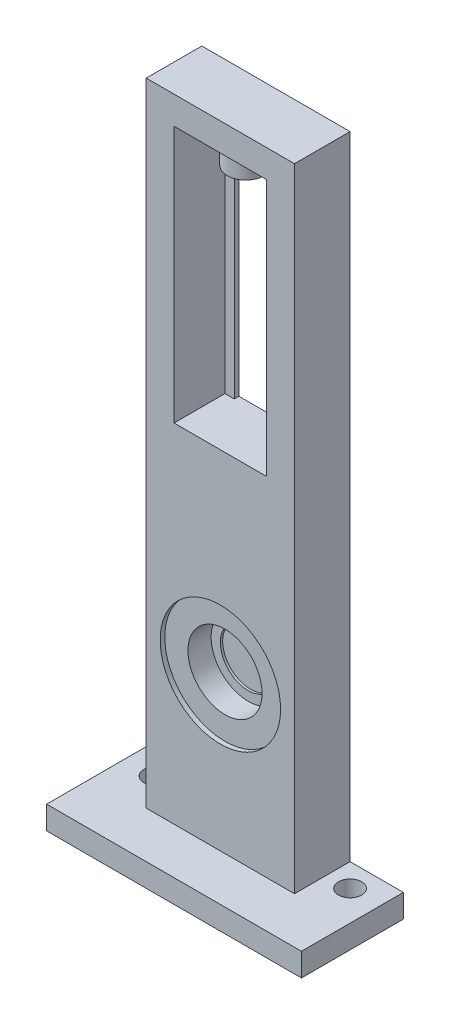
ISO-10303-21;
HEADER;
FILE_DESCRIPTION(('STEP AP214'),'2;1');
FILE_NAME('part.step','',(''),(''),'','','');
FILE_SCHEMA(('AUTOMOTIVE_DESIGN { 1 0 10303 214 1 1 1 1 }'));
ENDSEC;
DATA;
#1=APPLICATION_CONTEXT('core data for automotive mechanical design processes');
#2=APPLICATION_PROTOCOL_DEFINITION('international standard','automotive_design',2000,#1);
#3=PRODUCT_CONTEXT('',#1,'mechanical');
#4=PRODUCT('Part','Part','',(#3));
#5=PRODUCT_RELATED_PRODUCT_CATEGORY('part','',(#4));
#6=PRODUCT_DEFINITION_FORMATION('','',#4);
#7=PRODUCT_DEFINITION_CONTEXT('part definition',#1,'design');
#8=PRODUCT_DEFINITION('design','',#6,#7);
#9=PRODUCT_DEFINITION_SHAPE('','',#8);
#10=(LENGTH_UNIT() NAMED_UNIT(*) SI_UNIT(.MILLI.,.METRE.));
#11=(NAMED_UNIT(*) PLANE_ANGLE_UNIT() SI_UNIT($,.RADIAN.));
#12=(NAMED_UNIT(*) SI_UNIT($,.STERADIAN.) SOLID_ANGLE_UNIT());
#13=UNCERTAINTY_MEASURE_WITH_UNIT(LENGTH_MEASURE(1.E-05),#10,'distance_accuracy_value','');
#14=(GEOMETRIC_REPRESENTATION_CONTEXT(3) GLOBAL_UNCERTAINTY_ASSIGNED_CONTEXT((#13)) GLOBAL_UNIT_ASSIGNED_CONTEXT((#10,
#11,#12)) REPRESENTATION_CONTEXT('',''));
#15=CARTESIAN_POINT('',(0.,0.,0.));
#16=DIRECTION('',(0.,0.,1.));
#17=DIRECTION('',(1.,0.,0.));
#18=AXIS2_PLACEMENT_3D('',#15,#16,#17);
#19=CARTESIAN_POINT('',(10.,0.,11.));
#20=DIRECTION('',(1.,0.,0.));
#21=DIRECTION('',(0.,1.,0.));
#22=AXIS2_PLACEMENT_3D('',#19,#20,#21);
#23=PLANE('',#22);
#24=DIRECTION('',(0.,-1.,0.));
#25=VECTOR('',#24,1.);
#26=CARTESIAN_POINT('',(10.,0.,0.));
#27=LINE('',#26,#25);
#28=CARTESIAN_POINT('',(9.99999999999999,55.475378035092,0.));
#29=VERTEX_POINT('',#28);
#30=CARTESIAN_POINT('',(10.,0.,0.));
#31=VERTEX_POINT('',#30);
#32=EDGE_CURVE('E267',#29,#31,#27,.T.);
#33=ORIENTED_EDGE('',*,*,#32,.T.);
#34=DIRECTION('',(0.,0.,-1.));
#35=VECTOR('',#34,1.);
#36=CARTESIAN_POINT('',(10.,0.,11.));
#37=LINE('',#36,#35);
#38=CARTESIAN_POINT('',(10.,0.,11.));
#39=VERTEX_POINT('',#38);
#40=EDGE_CURVE('E305',#39,#31,#37,.T.);
#41=ORIENTED_EDGE('',*,*,#40,.F.);
#42=DIRECTION('',(0.,-1.,0.));
#43=VECTOR('',#42,1.);
#44=CARTESIAN_POINT('',(10.,0.,11.));
#45=LINE('',#44,#43);
#46=CARTESIAN_POINT('',(9.99999999999999,55.475378035092,11.));
#47=VERTEX_POINT('',#46);
#48=EDGE_CURVE('E268',#47,#39,#45,.T.);
#49=ORIENTED_EDGE('',*,*,#48,.F.);
#50=DIRECTION('',(0.,0.,-1.));
#51=VECTOR('',#50,1.);
#52=CARTESIAN_POINT('',(9.99999999999999,55.475378035092,11.));
#53=LINE('',#52,#51);
#54=EDGE_CURVE('E283',#47,#29,#53,.T.);
#55=ORIENTED_EDGE('',*,*,#54,.T.);
#56=EDGE_LOOP('',(#33,#41,#49,#55));
#57=FACE_BOUND('',#56,.T.);
#58=ADVANCED_FACE('F34',(#57),#23,.F.);
#59=CARTESIAN_POINT('',(16.,0.,11.));
#60=DIRECTION('',(-1.,0.,0.));
#61=DIRECTION('',(0.,-1.,0.));
#62=AXIS2_PLACEMENT_3D('',#59,#60,#61);
#63=PLANE('',#62);
#64=DIRECTION('',(0.,1.,0.));
#65=VECTOR('',#64,1.);
#66=CARTESIAN_POINT('',(16.,0.,11.));
#67=LINE('',#66,#65);
#68=CARTESIAN_POINT('',(16.,-75.,11.));
#69=VERTEX_POINT('',#68);
#70=CARTESIAN_POINT('',(16.,61.475378035092,11.));
#71=VERTEX_POINT('',#70);
#72=EDGE_CURVE('E271',#69,#71,#67,.T.);
#73=ORIENTED_EDGE('',*,*,#72,.F.);
#74=DIRECTION('',(0.,0.,-1.));
#75=VECTOR('',#74,1.);
#76=CARTESIAN_POINT('',(16.,-75.,11.));
#77=LINE('',#76,#75);
#78=CARTESIAN_POINT('',(16.,-75.,-1.));
#79=VERTEX_POINT('',#78);
#80=EDGE_CURVE('E204',#69,#79,#77,.T.);
#81=ORIENTED_EDGE('',*,*,#80,.T.);
#82=DIRECTION('',(0.,-1.,0.));
#83=VECTOR('',#82,1.);
#84=CARTESIAN_POINT('',(16.,0.,-1.));
#85=LINE('',#84,#83);
#86=CARTESIAN_POINT('',(16.,61.475378035092,-1.));
#87=VERTEX_POINT('',#86);
#88=EDGE_CURVE('E234',#87,#79,#85,.T.);
#89=ORIENTED_EDGE('',*,*,#88,.F.);
#90=DIRECTION('',(0.,0.,-1.));
#91=VECTOR('',#90,1.);
#92=CARTESIAN_POINT('',(16.,61.475378035092,11.));
#93=LINE('',#92,#91);
#94=EDGE_CURVE('E303',#71,#87,#93,.T.);
#95=ORIENTED_EDGE('',*,*,#94,.F.);
#96=EDGE_LOOP('',(#73,#81,#89,#95));
#97=FACE_BOUND('',#96,.T.);
#98=ADVANCED_FACE('F329',(#97),#63,.F.);
#99=CARTESIAN_POINT('',(-16.,61.4753780350919,11.));
#100=DIRECTION('',(0.,-1.,0.));
#101=DIRECTION('',(1.,0.,0.));
#102=AXIS2_PLACEMENT_3D('',#99,#100,#101);
#103=PLANE('',#102);
#104=ORIENTED_EDGE('',*,*,#94,.T.);
#105=DIRECTION('',(1.,0.,0.));
#106=VECTOR('',#105,1.);
#107=CARTESIAN_POINT('',(16.,61.475378035092,-1.));
#108=LINE('',#107,#106);
#109=CARTESIAN_POINT('',(-16.,61.4753780350919,-1.));
#110=VERTEX_POINT('',#109);
#111=EDGE_CURVE('E231',#110,#87,#108,.T.);
#112=ORIENTED_EDGE('',*,*,#111,.F.);
#113=DIRECTION('',(0.,0.,-1.));
#114=VECTOR('',#113,1.);
#115=CARTESIAN_POINT('',(-16.,61.4753780350919,11.));
#116=LINE('',#115,#114);
#117=CARTESIAN_POINT('',(-16.,61.4753780350919,11.));
#118=VERTEX_POINT('',#117);
#119=EDGE_CURVE('E300',#118,#110,#116,.T.);
#120=ORIENTED_EDGE('',*,*,#119,.F.);
#121=DIRECTION('',(-1.,0.,0.));
#122=VECTOR('',#121,1.);
#123=CARTESIAN_POINT('',(-16.,61.4753780350919,11.));
#124=LINE('',#123,#122);
#125=EDGE_CURVE('E274',#71,#118,#124,.T.);
#126=ORIENTED_EDGE('',*,*,#125,.F.);
#127=EDGE_LOOP('',(#104,#112,#120,#126));
#128=FACE_BOUND('',#127,.T.);
#129=ADVANCED_FACE('F334',(#128),#103,.F.);
#130=CARTESIAN_POINT('',(-16.,61.4753780350919,11.));
#131=DIRECTION('',(1.,0.,0.));
#132=DIRECTION('',(0.,1.,0.));
#133=AXIS2_PLACEMENT_3D('',#130,#131,#132);
#134=PLANE('',#133);
#135=DIRECTION('',(0.,1.,0.));
#136=VECTOR('',#135,1.);
#137=CARTESIAN_POINT('',(-16.,61.4753780350919,-1.));
#138=LINE('',#137,#136);
#139=CARTESIAN_POINT('',(-16.,-75.,-1.));
#140=VERTEX_POINT('',#139);
#141=EDGE_CURVE('E245',#140,#110,#138,.T.);
#142=ORIENTED_EDGE('',*,*,#141,.F.);
#143=DIRECTION('',(0.,0.,1.));
#144=VECTOR('',#143,1.);
#145=CARTESIAN_POINT('',(-16.,-75.,11.));
#146=LINE('',#145,#144);
#147=CARTESIAN_POINT('',(-16.,-75.,11.));
#148=VERTEX_POINT('',#147);
#149=EDGE_CURVE('E201',#140,#148,#146,.T.);
#150=ORIENTED_EDGE('',*,*,#149,.T.);
#151=DIRECTION('',(0.,-1.,0.));
#152=VECTOR('',#151,1.);
#153=CARTESIAN_POINT('',(-16.,61.4753780350919,11.));
#154=LINE('',#153,#152);
#155=EDGE_CURVE('E276',#118,#148,#154,.T.);
#156=ORIENTED_EDGE('',*,*,#155,.F.);
#157=ORIENTED_EDGE('',*,*,#119,.T.);
#158=EDGE_LOOP('',(#142,#150,#156,#157));
#159=FACE_BOUND('',#158,.T.);
#160=ADVANCED_FACE('F388',(#159),#134,.F.);
#161=CARTESIAN_POINT('',(-10.,55.475378035092,11.));
#162=DIRECTION('',(-1.,0.,0.));
#163=DIRECTION('',(0.,-1.,0.));
#164=AXIS2_PLACEMENT_3D('',#161,#162,#163);
#165=PLANE('',#164);
#166=DIRECTION('',(0.,1.,0.));
#167=VECTOR('',#166,1.);
#168=CARTESIAN_POINT('',(-10.,55.475378035092,0.));
#169=LINE('',#168,#167);
#170=CARTESIAN_POINT('',(-10.,0.,0.));
#171=VERTEX_POINT('',#170);
#172=CARTESIAN_POINT('',(-10.,55.475378035092,0.));
#173=VERTEX_POINT('',#172);
#174=EDGE_CURVE('E286',#171,#173,#169,.T.);
#175=ORIENTED_EDGE('',*,*,#174,.T.);
#176=DIRECTION('',(0.,0.,-1.));
#177=VECTOR('',#176,1.);
#178=CARTESIAN_POINT('',(-10.,55.475378035092,11.));
#179=LINE('',#178,#177);
#180=CARTESIAN_POINT('',(-10.,55.475378035092,11.));
#181=VERTEX_POINT('',#180);
#182=EDGE_CURVE('E294',#181,#173,#179,.T.);
#183=ORIENTED_EDGE('',*,*,#182,.F.);
#184=DIRECTION('',(0.,1.,0.));
#185=VECTOR('',#184,1.);
#186=CARTESIAN_POINT('',(-10.,55.475378035092,11.));
#187=LINE('',#186,#185);
#188=CARTESIAN_POINT('',(-10.,0.,11.));
#189=VERTEX_POINT('',#188);
#190=EDGE_CURVE('E279',#189,#181,#187,.T.);
#191=ORIENTED_EDGE('',*,*,#190,.F.);
#192=DIRECTION('',(0.,0.,-1.));
#193=VECTOR('',#192,1.);
#194=CARTESIAN_POINT('',(-10.,0.,11.));
#195=LINE('',#194,#193);
#196=EDGE_CURVE('E297',#189,#171,#195,.T.);
#197=ORIENTED_EDGE('',*,*,#196,.T.);
#198=EDGE_LOOP('',(#175,#183,#191,#197));
#199=FACE_BOUND('',#198,.T.);
#200=ADVANCED_FACE('F370',(#199),#165,.F.);
#201=CARTESIAN_POINT('',(-10.,55.475378035092,11.));
#202=DIRECTION('',(0.,1.,0.));
#203=DIRECTION('',(-1.,0.,0.));
#204=AXIS2_PLACEMENT_3D('',#201,#202,#203);
#205=PLANE('',#204);
#206=CARTESIAN_POINT('',(0.,55.475378035092,5.5));
#207=DIRECTION('',(0.,1.,0.));
#208=DIRECTION('',(-1.,0.,0.));
#209=AXIS2_PLACEMENT_3D('',#206,#207,#208);
#210=CIRCLE('',#209,4.);
#211=CARTESIAN_POINT('',(-4.00000000000002,55.475378035092,5.5));
#212=VERTEX_POINT('',#211);
#213=EDGE_CURVE('E11',#212,#212,#210,.F.);
#214=ORIENTED_EDGE('',*,*,#213,.F.);
#215=EDGE_LOOP('',(#214));
#216=FACE_BOUND('',#215,.T.);
#217=DIRECTION('',(1.,0.,0.));
#218=VECTOR('',#217,1.);
#219=CARTESIAN_POINT('',(-10.,55.475378035092,0.));
#220=LINE('',#219,#218);
#221=CARTESIAN_POINT('',(-7.99999999999999,55.475378035092,0.));
#222=VERTEX_POINT('',#221);
#223=EDGE_CURVE('E272',#173,#222,#220,.T.);
#224=ORIENTED_EDGE('',*,*,#223,.T.);
#225=CARTESIAN_POINT('',(7.99999999999998,55.475378035092,0.));
#226=VERTEX_POINT('',#225);
#227=EDGE_CURVE('E291',#222,#226,#220,.T.);
#228=ORIENTED_EDGE('',*,*,#227,.T.);
#229=EDGE_CURVE('E288',#226,#29,#220,.T.);
#230=ORIENTED_EDGE('',*,*,#229,.T.);
#231=ORIENTED_EDGE('',*,*,#54,.F.);
#232=DIRECTION('',(1.,0.,0.));
#233=VECTOR('',#232,1.);
#234=CARTESIAN_POINT('',(-10.,55.475378035092,11.));
#235=LINE('',#234,#233);
#236=EDGE_CURVE('E281',#181,#47,#235,.T.);
#237=ORIENTED_EDGE('',*,*,#236,.F.);
#238=ORIENTED_EDGE('',*,*,#182,.T.);
#239=EDGE_LOOP('',(#224,#228,#230,#231,#237,#238));
#240=FACE_BOUND('',#239,.T.);
#241=ADVANCED_FACE('F374',(#216,#240),#205,.F.);
#242=CARTESIAN_POINT('',(0.,0.,11.));
#243=DIRECTION('',(0.,0.,-1.));
#244=DIRECTION('',(-1.,0.,0.));
#245=AXIS2_PLACEMENT_3D('',#242,#243,#244);
#246=PLANE('',#245);
#247=CARTESIAN_POINT('',(0.,-42.0246219649081,11.));
#248=DIRECTION('',(0.,0.,1.));
#249=DIRECTION('',(1.,0.,0.));
#250=AXIS2_PLACEMENT_3D('',#247,#248,#249);
#251=CIRCLE('',#250,13.);
#252=CARTESIAN_POINT('',(13.,-42.0246219649081,11.));
#253=VERTEX_POINT('',#252);
#254=EDGE_CURVE('E207',#253,#253,#251,.T.);
#255=ORIENTED_EDGE('',*,*,#254,.F.);
#256=EDGE_LOOP('',(#255));
#257=FACE_BOUND('',#256,.T.);
#258=DIRECTION('',(-1.,0.,0.));
#259=VECTOR('',#258,1.);
#260=CARTESIAN_POINT('',(16.,0.,11.));
#261=LINE('',#260,#259);
#262=EDGE_CURVE('E223',#39,#189,#261,.T.);
#263=ORIENTED_EDGE('',*,*,#262,.T.);
#264=ORIENTED_EDGE('',*,*,#190,.T.);
#265=ORIENTED_EDGE('',*,*,#236,.T.);
#266=ORIENTED_EDGE('',*,*,#48,.T.);
#267=EDGE_LOOP('',(#263,#264,#265,#266));
#268=FACE_BOUND('',#267,.T.);
#269=ORIENTED_EDGE('',*,*,#155,.T.);
#270=DIRECTION('',(1.,0.,0.));
#271=VECTOR('',#270,1.);
#272=CARTESIAN_POINT('',(0.,-75.,11.));
#273=LINE('',#272,#271);
#274=EDGE_CURVE('E194',#148,#69,#273,.T.);
#275=ORIENTED_EDGE('',*,*,#274,.T.);
#276=ORIENTED_EDGE('',*,*,#72,.T.);
#277=ORIENTED_EDGE('',*,*,#125,.T.);
#278=EDGE_LOOP('',(#269,#275,#276,#277));
#279=FACE_BOUND('',#278,.T.);
#280=ADVANCED_FACE('F376',(#257,#268,#279),#246,.F.);
#281=CARTESIAN_POINT('',(0.,0.,0.));
#282=DIRECTION('',(0.,0.,-1.));
#283=DIRECTION('',(-1.,0.,0.));
#284=AXIS2_PLACEMENT_3D('',#281,#282,#283);
#285=PLANE('',#284);
#286=DIRECTION('',(0.,-1.,0.));
#287=VECTOR('',#286,1.);
#288=CARTESIAN_POINT('',(-8.,0.,0.));
#289=LINE('',#288,#287);
#290=CARTESIAN_POINT('',(-7.99999999999998,55.9753780350919,0.));
#291=VERTEX_POINT('',#290);
#292=EDGE_CURVE('E48',#291,#222,#289,.T.);
#293=ORIENTED_EDGE('',*,*,#292,.F.);
#294=DIRECTION('',(-1.,0.,0.));
#295=VECTOR('',#294,1.);
#296=CARTESIAN_POINT('',(-7.99999999999998,55.9753780350919,0.));
#297=LINE('',#296,#295);
#298=CARTESIAN_POINT('',(7.99999999999998,55.9753780350919,0.));
#299=VERTEX_POINT('',#298);
#300=EDGE_CURVE('E252',#299,#291,#297,.T.);
#301=ORIENTED_EDGE('',*,*,#300,.F.);
#302=DIRECTION('',(0.,1.,0.));
#303=VECTOR('',#302,1.);
#304=CARTESIAN_POINT('',(7.99999999999998,55.9753780350919,0.));
#305=LINE('',#304,#303);
#306=EDGE_CURVE('E41',#226,#299,#305,.T.);
#307=ORIENTED_EDGE('',*,*,#306,.F.);
#308=ORIENTED_EDGE('',*,*,#227,.F.);
#309=EDGE_LOOP('',(#293,#301,#307,#308));
#310=FACE_BOUND('',#309,.T.);
#311=ADVANCED_FACE('F379',(#310),#285,.T.);
#312=CARTESIAN_POINT('',(0.,0.,0.));
#313=DIRECTION('',(0.,0.,1.));
#314=DIRECTION('',(1.,0.,0.));
#315=AXIS2_PLACEMENT_3D('',#312,#313,#314);
#316=PLANE('',#315);
#317=ORIENTED_EDGE('',*,*,#32,.F.);
#318=ORIENTED_EDGE('',*,*,#229,.F.);
#319=CARTESIAN_POINT('',(7.99999999999999,0.,0.));
#320=VERTEX_POINT('',#319);
#321=EDGE_CURVE('E249',#320,#226,#305,.T.);
#322=ORIENTED_EDGE('',*,*,#321,.F.);
#323=DIRECTION('',(-1.,0.,0.));
#324=VECTOR('',#323,1.);
#325=CARTESIAN_POINT('',(16.,0.,0.));
#326=LINE('',#325,#324);
#327=EDGE_CURVE('E226',#31,#320,#326,.T.);
#328=ORIENTED_EDGE('',*,*,#327,.F.);
#329=EDGE_LOOP('',(#317,#318,#322,#328));
#330=FACE_BOUND('',#329,.T.);
#331=ADVANCED_FACE('F344',(#330),#316,.T.);
#332=ORIENTED_EDGE('',*,*,#223,.F.);
#333=ORIENTED_EDGE('',*,*,#174,.F.);
#334=DIRECTION('',(-1.,0.,0.));
#335=VECTOR('',#334,1.);
#336=CARTESIAN_POINT('',(-8.,0.,0.));
#337=LINE('',#336,#335);
#338=CARTESIAN_POINT('',(-8.,0.,0.));
#339=VERTEX_POINT('',#338);
#340=EDGE_CURVE('E235',#339,#171,#337,.T.);
#341=ORIENTED_EDGE('',*,*,#340,.F.);
#342=EDGE_CURVE('E254',#222,#339,#289,.T.);
#343=ORIENTED_EDGE('',*,*,#342,.F.);
#344=EDGE_LOOP('',(#332,#333,#341,#343));
#345=FACE_BOUND('',#344,.T.);
#346=ADVANCED_FACE('F367',(#345),#316,.T.);
#347=CARTESIAN_POINT('',(7.99999999999998,55.9753780350919,-1.));
#348=DIRECTION('',(1.,0.,0.));
#349=DIRECTION('',(0.,1.,0.));
#350=AXIS2_PLACEMENT_3D('',#347,#348,#349);
#351=PLANE('',#350);
#352=ORIENTED_EDGE('',*,*,#321,.T.);
#353=ORIENTED_EDGE('',*,*,#306,.T.);
#354=DIRECTION('',(0.,0.,1.));
#355=VECTOR('',#354,1.);
#356=CARTESIAN_POINT('',(7.99999999999998,55.9753780350919,-1.));
#357=LINE('',#356,#355);
#358=CARTESIAN_POINT('',(7.99999999999998,55.9753780350919,-1.));
#359=VERTEX_POINT('',#358);
#360=EDGE_CURVE('E261',#359,#299,#357,.T.);
#361=ORIENTED_EDGE('',*,*,#360,.F.);
#362=DIRECTION('',(0.,1.,0.));
#363=VECTOR('',#362,1.);
#364=CARTESIAN_POINT('',(7.99999999999998,55.9753780350919,-1.));
#365=LINE('',#364,#363);
#366=CARTESIAN_POINT('',(7.99999999999999,0.,-1.));
#367=VERTEX_POINT('',#366);
#368=EDGE_CURVE('E238',#367,#359,#365,.T.);
#369=ORIENTED_EDGE('',*,*,#368,.F.);
#370=DIRECTION('',(0.,0.,1.));
#371=VECTOR('',#370,1.);
#372=CARTESIAN_POINT('',(7.99999999999999,0.,-1.));
#373=LINE('',#372,#371);
#374=EDGE_CURVE('E264',#367,#320,#373,.T.);
#375=ORIENTED_EDGE('',*,*,#374,.T.);
#376=EDGE_LOOP('',(#352,#353,#361,#369,#375));
#377=FACE_BOUND('',#376,.T.);
#378=ADVANCED_FACE('F350',(#377),#351,.F.);
#379=CARTESIAN_POINT('',(-7.99999999999998,55.9753780350919,-1.));
#380=DIRECTION('',(0.,1.,0.));
#381=DIRECTION('',(0.,0.,1.));
#382=AXIS2_PLACEMENT_3D('',#379,#380,#381);
#383=PLANE('',#382);
#384=ORIENTED_EDGE('',*,*,#300,.T.);
#385=DIRECTION('',(0.,0.,1.));
#386=VECTOR('',#385,1.);
#387=CARTESIAN_POINT('',(-7.99999999999998,55.9753780350919,-1.));
#388=LINE('',#387,#386);
#389=CARTESIAN_POINT('',(-7.99999999999998,55.9753780350919,-1.));
#390=VERTEX_POINT('',#389);
#391=EDGE_CURVE('E258',#390,#291,#388,.T.);
#392=ORIENTED_EDGE('',*,*,#391,.F.);
#393=DIRECTION('',(-1.,0.,0.));
#394=VECTOR('',#393,1.);
#395=CARTESIAN_POINT('',(-7.99999999999998,55.9753780350919,-1.));
#396=LINE('',#395,#394);
#397=EDGE_CURVE('E240',#359,#390,#396,.T.);
#398=ORIENTED_EDGE('',*,*,#397,.F.);
#399=ORIENTED_EDGE('',*,*,#360,.T.);
#400=EDGE_LOOP('',(#384,#392,#398,#399));
#401=FACE_BOUND('',#400,.T.);
#402=ADVANCED_FACE('F415',(#401),#383,.F.);
#403=CARTESIAN_POINT('',(-8.,0.,-1.));
#404=DIRECTION('',(-1.,0.,0.));
#405=DIRECTION('',(0.,-1.,0.));
#406=AXIS2_PLACEMENT_3D('',#403,#404,#405);
#407=PLANE('',#406);
#408=ORIENTED_EDGE('',*,*,#292,.T.);
#409=ORIENTED_EDGE('',*,*,#342,.T.);
#410=DIRECTION('',(0.,0.,1.));
#411=VECTOR('',#410,1.);
#412=CARTESIAN_POINT('',(-8.,0.,-1.));
#413=LINE('',#412,#411);
#414=CARTESIAN_POINT('',(-7.99999999999999,0.,-1.));
#415=VERTEX_POINT('',#414);
#416=EDGE_CURVE('E247',#415,#339,#413,.T.);
#417=ORIENTED_EDGE('',*,*,#416,.F.);
#418=DIRECTION('',(0.,-1.,0.));
#419=VECTOR('',#418,1.);
#420=CARTESIAN_POINT('',(-8.,0.,-1.));
#421=LINE('',#420,#419);
#422=EDGE_CURVE('E242',#390,#415,#421,.T.);
#423=ORIENTED_EDGE('',*,*,#422,.F.);
#424=ORIENTED_EDGE('',*,*,#391,.T.);
#425=EDGE_LOOP('',(#408,#409,#417,#423,#424));
#426=FACE_BOUND('',#425,.T.);
#427=ADVANCED_FACE('F363',(#426),#407,.F.);
#428=CARTESIAN_POINT('',(0.,0.,-1.));
#429=DIRECTION('',(0.,0.,1.));
#430=DIRECTION('',(1.,0.,0.));
#431=AXIS2_PLACEMENT_3D('',#428,#429,#430);
#432=PLANE('',#431);
#433=DIRECTION('',(1.,0.,0.));
#434=VECTOR('',#433,1.);
#435=CARTESIAN_POINT('',(16.,0.,-1.));
#436=LINE('',#435,#434);
#437=EDGE_CURVE('E227',#415,#367,#436,.T.);
#438=ORIENTED_EDGE('',*,*,#437,.T.);
#439=ORIENTED_EDGE('',*,*,#368,.T.);
#440=ORIENTED_EDGE('',*,*,#397,.T.);
#441=ORIENTED_EDGE('',*,*,#422,.T.);
#442=EDGE_LOOP('',(#438,#439,#440,#441));
#443=FACE_BOUND('',#442,.T.);
#444=ORIENTED_EDGE('',*,*,#88,.T.);
#445=DIRECTION('',(1.,0.,0.));
#446=VECTOR('',#445,1.);
#447=CARTESIAN_POINT('',(-27.5,-75.,-1.));
#448=LINE('',#447,#446);
#449=CARTESIAN_POINT('',(27.5,-75.,-1.));
#450=VERTEX_POINT('',#449);
#451=EDGE_CURVE('E188',#79,#450,#448,.T.);
#452=ORIENTED_EDGE('',*,*,#451,.T.);
#453=DIRECTION('',(0.,-1.,0.));
#454=VECTOR('',#453,1.);
#455=CARTESIAN_POINT('',(27.5,-80.,-1.));
#456=LINE('',#455,#454);
#457=CARTESIAN_POINT('',(27.5,-80.,-1.));
#458=VERTEX_POINT('',#457);
#459=EDGE_CURVE('E185',#450,#458,#456,.T.);
#460=ORIENTED_EDGE('',*,*,#459,.T.);
#461=DIRECTION('',(1.,0.,0.));
#462=VECTOR('',#461,1.);
#463=CARTESIAN_POINT('',(16.,-80.,-1.));
#464=LINE('',#463,#462);
#465=CARTESIAN_POINT('',(-27.5,-80.,-1.));
#466=VERTEX_POINT('',#465);
#467=EDGE_CURVE('E224',#466,#458,#464,.T.);
#468=ORIENTED_EDGE('',*,*,#467,.F.);
#469=DIRECTION('',(0.,1.,0.));
#470=VECTOR('',#469,1.);
#471=CARTESIAN_POINT('',(-27.5,-80.,-1.));
#472=LINE('',#471,#470);
#473=CARTESIAN_POINT('',(-27.5,-75.,-1.));
#474=VERTEX_POINT('',#473);
#475=EDGE_CURVE('E157',#466,#474,#472,.T.);
#476=ORIENTED_EDGE('',*,*,#475,.T.);
#477=EDGE_CURVE('E190',#474,#140,#448,.T.);
#478=ORIENTED_EDGE('',*,*,#477,.T.);
#479=ORIENTED_EDGE('',*,*,#141,.T.);
#480=ORIENTED_EDGE('',*,*,#111,.T.);
#481=EDGE_LOOP('',(#444,#452,#460,#468,#476,#478,#479,#480));
#482=FACE_BOUND('',#481,.T.);
#483=ADVANCED_FACE('F354',(#443,#482),#432,.F.);
#484=CARTESIAN_POINT('',(0.,0.,0.));
#485=DIRECTION('',(0.,1.,0.));
#486=DIRECTION('',(-1.,0.,0.));
#487=AXIS2_PLACEMENT_3D('',#484,#485,#486);
#488=PLANE('',#487);
#489=ORIENTED_EDGE('',*,*,#40,.T.);
#490=ORIENTED_EDGE('',*,*,#327,.T.);
#491=ORIENTED_EDGE('',*,*,#374,.F.);
#492=ORIENTED_EDGE('',*,*,#437,.F.);
#493=ORIENTED_EDGE('',*,*,#416,.T.);
#494=ORIENTED_EDGE('',*,*,#340,.T.);
#495=ORIENTED_EDGE('',*,*,#196,.F.);
#496=ORIENTED_EDGE('',*,*,#262,.F.);
#497=EDGE_LOOP('',(#489,#490,#491,#492,#493,#494,#495,#496));
#498=FACE_BOUND('',#497,.T.);
#499=ADVANCED_FACE('F347',(#498),#488,.T.);
#500=CARTESIAN_POINT('',(0.,-80.,0.));
#501=DIRECTION('',(0.,1.,0.));
#502=DIRECTION('',(-1.,0.,0.));
#503=AXIS2_PLACEMENT_3D('',#500,#501,#502);
#504=PLANE('',#503);
#505=CARTESIAN_POINT('',(21.,-80.,3.99999999999999));
#506=DIRECTION('',(0.,1.,0.));
#507=DIRECTION('',(0.,0.,1.));
#508=AXIS2_PLACEMENT_3D('',#505,#506,#507);
#509=CIRCLE('',#508,2.5);
#510=CARTESIAN_POINT('',(21.,-80.,6.49999999999999));
#511=VERTEX_POINT('',#510);
#512=EDGE_CURVE('E174',#511,#511,#509,.T.);
#513=ORIENTED_EDGE('',*,*,#512,.T.);
#514=EDGE_LOOP('',(#513));
#515=FACE_BOUND('',#514,.T.);
#516=CARTESIAN_POINT('',(-21.,-80.,4.));
#517=DIRECTION('',(0.,1.,0.));
#518=DIRECTION('',(0.,0.,1.));
#519=AXIS2_PLACEMENT_3D('',#516,#517,#518);
#520=CIRCLE('',#519,2.5);
#521=CARTESIAN_POINT('',(-21.,-80.,6.5));
#522=VERTEX_POINT('',#521);
#523=EDGE_CURVE('E438',#522,#522,#520,.T.);
#524=ORIENTED_EDGE('',*,*,#523,.T.);
#525=EDGE_LOOP('',(#524));
#526=FACE_BOUND('',#525,.T.);
#527=DIRECTION('',(0.,0.,1.));
#528=VECTOR('',#527,1.);
#529=CARTESIAN_POINT('',(-27.5,-80.,-56.2268050859363));
#530=LINE('',#529,#528);
#531=CARTESIAN_POINT('',(-27.5,-80.,21.));
#532=VERTEX_POINT('',#531);
#533=EDGE_CURVE('E151',#466,#532,#530,.T.);
#534=ORIENTED_EDGE('',*,*,#533,.F.);
#535=ORIENTED_EDGE('',*,*,#467,.T.);
#536=DIRECTION('',(0.,0.,1.));
#537=VECTOR('',#536,1.);
#538=CARTESIAN_POINT('',(27.5,-80.,-56.2268050859363));
#539=LINE('',#538,#537);
#540=CARTESIAN_POINT('',(27.5,-80.,21.));
#541=VERTEX_POINT('',#540);
#542=EDGE_CURVE('E159',#458,#541,#539,.T.);
#543=ORIENTED_EDGE('',*,*,#542,.T.);
#544=DIRECTION('',(1.,0.,0.));
#545=VECTOR('',#544,1.);
#546=CARTESIAN_POINT('',(-27.5,-80.,21.));
#547=LINE('',#546,#545);
#548=EDGE_CURVE('E163',#532,#541,#547,.T.);
#549=ORIENTED_EDGE('',*,*,#548,.F.);
#550=EDGE_LOOP('',(#534,#535,#543,#549));
#551=FACE_BOUND('',#550,.T.);
#552=ADVANCED_FACE('F164',(#515,#526,#551),#504,.F.);
#553=CARTESIAN_POINT('',(0.,-42.0246219649081,10.));
#554=DIRECTION('',(0.,0.,1.));
#555=DIRECTION('',(1.,0.,0.));
#556=AXIS2_PLACEMENT_3D('',#553,#554,#555);
#557=PLANE('',#556);
#558=CARTESIAN_POINT('',(0.,-42.0246219649081,10.));
#559=DIRECTION('',(0.,0.,1.));
#560=DIRECTION('',(1.,0.,0.));
#561=AXIS2_PLACEMENT_3D('',#558,#559,#560);
#562=CIRCLE('',#561,13.);
#563=CARTESIAN_POINT('',(13.,-42.0246219649081,10.));
#564=VERTEX_POINT('',#563);
#565=EDGE_CURVE('E208',#564,#564,#562,.T.);
#566=ORIENTED_EDGE('',*,*,#565,.T.);
#567=EDGE_LOOP('',(#566));
#568=FACE_BOUND('',#567,.T.);
#569=CARTESIAN_POINT('',(0.,-42.0246219649081,10.));
#570=DIRECTION('',(0.,0.,1.));
#571=DIRECTION('',(1.,0.,0.));
#572=AXIS2_PLACEMENT_3D('',#569,#570,#571);
#573=CIRCLE('',#572,8.);
#574=CARTESIAN_POINT('',(8.,-42.0246219649081,10.));
#575=VERTEX_POINT('',#574);
#576=EDGE_CURVE('E211',#575,#575,#573,.F.);
#577=ORIENTED_EDGE('',*,*,#576,.T.);
#578=EDGE_LOOP('',(#577));
#579=FACE_BOUND('',#578,.T.);
#580=ADVANCED_FACE('F309',(#568,#579),#557,.T.);
#581=CARTESIAN_POINT('',(0.,-42.0246219649081,10.));
#582=DIRECTION('',(0.,0.,1.));
#583=DIRECTION('',(1.,0.,0.));
#584=AXIS2_PLACEMENT_3D('',#581,#582,#583);
#585=CYLINDRICAL_SURFACE('',#584,13.);
#586=ORIENTED_EDGE('',*,*,#565,.F.);
#587=EDGE_LOOP('',(#586));
#588=FACE_BOUND('',#587,.T.);
#589=ORIENTED_EDGE('',*,*,#254,.T.);
#590=EDGE_LOOP('',(#589));
#591=FACE_BOUND('',#590,.T.);
#592=ADVANCED_FACE('F431',(#588,#591),#585,.F.);
#593=CARTESIAN_POINT('',(0.,-42.0246219649081,4.5));
#594=DIRECTION('',(0.,0.,1.));
#595=DIRECTION('',(1.,0.,0.));
#596=AXIS2_PLACEMENT_3D('',#593,#594,#595);
#597=PLANE('',#596);
#598=CARTESIAN_POINT('',(0.,-42.0246219649081,4.5));
#599=DIRECTION('',(0.,0.,1.));
#600=DIRECTION('',(1.,0.,0.));
#601=AXIS2_PLACEMENT_3D('',#598,#599,#600);
#602=CIRCLE('',#601,6.);
#603=CARTESIAN_POINT('',(6.,-42.0246219649081,4.5));
#604=VERTEX_POINT('',#603);
#605=EDGE_CURVE('E214',#604,#604,#602,.T.);
#606=ORIENTED_EDGE('',*,*,#605,.T.);
#607=EDGE_LOOP('',(#606));
#608=FACE_BOUND('',#607,.T.);
#609=ADVANCED_FACE('F475',(#608),#597,.T.);
#610=CARTESIAN_POINT('',(0.,-42.0246219649081,4.5));
#611=DIRECTION('',(0.,0.,1.));
#612=DIRECTION('',(1.,0.,0.));
#613=AXIS2_PLACEMENT_3D('',#610,#611,#612);
#614=CYLINDRICAL_SURFACE('',#613,6.);
#615=ORIENTED_EDGE('',*,*,#605,.F.);
#616=EDGE_LOOP('',(#615));
#617=FACE_BOUND('',#616,.T.);
#618=CARTESIAN_POINT('',(0.,-42.0246219649081,5.));
#619=DIRECTION('',(0.,0.,1.));
#620=DIRECTION('',(1.,0.,0.));
#621=AXIS2_PLACEMENT_3D('',#618,#619,#620);
#622=CIRCLE('',#621,6.);
#623=CARTESIAN_POINT('',(6.,-42.0246219649081,5.));
#624=VERTEX_POINT('',#623);
#625=EDGE_CURVE('E218',#624,#624,#622,.T.);
#626=ORIENTED_EDGE('',*,*,#625,.T.);
#627=EDGE_LOOP('',(#626));
#628=FACE_BOUND('',#627,.T.);
#629=ADVANCED_FACE('F323',(#617,#628),#614,.F.);
#630=CARTESIAN_POINT('',(0.,-42.0246219649081,5.));
#631=DIRECTION('',(0.,0.,1.));
#632=DIRECTION('',(1.,0.,0.));
#633=AXIS2_PLACEMENT_3D('',#630,#631,#632);
#634=PLANE('',#633);
#635=ORIENTED_EDGE('',*,*,#625,.F.);
#636=EDGE_LOOP('',(#635));
#637=FACE_BOUND('',#636,.T.);
#638=CARTESIAN_POINT('',(0.,-42.0246219649081,5.));
#639=DIRECTION('',(0.,0.,1.));
#640=DIRECTION('',(1.,0.,0.));
#641=AXIS2_PLACEMENT_3D('',#638,#639,#640);
#642=CIRCLE('',#641,8.);
#643=CARTESIAN_POINT('',(8.,-42.0246219649081,5.));
#644=VERTEX_POINT('',#643);
#645=EDGE_CURVE('E217',#644,#644,#642,.T.);
#646=ORIENTED_EDGE('',*,*,#645,.T.);
#647=EDGE_LOOP('',(#646));
#648=FACE_BOUND('',#647,.T.);
#649=ADVANCED_FACE('F314',(#637,#648),#634,.T.);
#650=CARTESIAN_POINT('',(0.,-42.0246219649081,5.));
#651=DIRECTION('',(0.,0.,1.));
#652=DIRECTION('',(1.,0.,0.));
#653=AXIS2_PLACEMENT_3D('',#650,#651,#652);
#654=CYLINDRICAL_SURFACE('',#653,8.);
#655=ORIENTED_EDGE('',*,*,#645,.F.);
#656=EDGE_LOOP('',(#655));
#657=FACE_BOUND('',#656,.T.);
#658=ORIENTED_EDGE('',*,*,#576,.F.);
#659=EDGE_LOOP('',(#658));
#660=FACE_BOUND('',#659,.T.);
#661=ADVANCED_FACE('F311',(#657,#660),#654,.F.);
#662=CARTESIAN_POINT('',(-27.5,-75.,-56.2268050859363));
#663=DIRECTION('',(0.,1.,0.));
#664=DIRECTION('',(0.,0.,1.));
#665=AXIS2_PLACEMENT_3D('',#662,#663,#664);
#666=PLANE('',#665);
#667=CARTESIAN_POINT('',(21.,-75.,3.99999999999999));
#668=DIRECTION('',(0.,1.,0.));
#669=DIRECTION('',(0.,0.,1.));
#670=AXIS2_PLACEMENT_3D('',#667,#668,#669);
#671=CIRCLE('',#670,2.5);
#672=CARTESIAN_POINT('',(21.,-75.,6.49999999999999));
#673=VERTEX_POINT('',#672);
#674=EDGE_CURVE('E177',#673,#673,#671,.T.);
#675=ORIENTED_EDGE('',*,*,#674,.F.);
#676=EDGE_LOOP('',(#675));
#677=FACE_BOUND('',#676,.T.);
#678=CARTESIAN_POINT('',(-21.,-75.,4.));
#679=DIRECTION('',(0.,1.,0.));
#680=DIRECTION('',(0.,0.,1.));
#681=AXIS2_PLACEMENT_3D('',#678,#679,#680);
#682=CIRCLE('',#681,2.5);
#683=CARTESIAN_POINT('',(-21.,-75.,6.5));
#684=VERTEX_POINT('',#683);
#685=EDGE_CURVE('E180',#684,#684,#682,.T.);
#686=ORIENTED_EDGE('',*,*,#685,.F.);
#687=EDGE_LOOP('',(#686));
#688=FACE_BOUND('',#687,.T.);
#689=ORIENTED_EDGE('',*,*,#80,.F.);
#690=ORIENTED_EDGE('',*,*,#274,.F.);
#691=ORIENTED_EDGE('',*,*,#149,.F.);
#692=ORIENTED_EDGE('',*,*,#477,.F.);
#693=DIRECTION('',(0.,0.,1.));
#694=VECTOR('',#693,1.);
#695=CARTESIAN_POINT('',(-27.5,-75.,-56.2268050859363));
#696=LINE('',#695,#694);
#697=CARTESIAN_POINT('',(-27.5,-75.,21.));
#698=VERTEX_POINT('',#697);
#699=EDGE_CURVE('E189',#474,#698,#696,.T.);
#700=ORIENTED_EDGE('',*,*,#699,.T.);
#701=DIRECTION('',(-1.,0.,0.));
#702=VECTOR('',#701,1.);
#703=CARTESIAN_POINT('',(-27.5,-75.,21.));
#704=LINE('',#703,#702);
#705=CARTESIAN_POINT('',(27.5,-75.,21.));
#706=VERTEX_POINT('',#705);
#707=EDGE_CURVE('E160',#706,#698,#704,.T.);
#708=ORIENTED_EDGE('',*,*,#707,.F.);
#709=DIRECTION('',(0.,0.,1.));
#710=VECTOR('',#709,1.);
#711=CARTESIAN_POINT('',(27.5,-75.,-56.2268050859363));
#712=LINE('',#711,#710);
#713=EDGE_CURVE('E196',#450,#706,#712,.T.);
#714=ORIENTED_EDGE('',*,*,#713,.F.);
#715=ORIENTED_EDGE('',*,*,#451,.F.);
#716=EDGE_LOOP('',(#689,#690,#691,#692,#700,#708,#714,#715));
#717=FACE_BOUND('',#716,.T.);
#718=ADVANCED_FACE('F313',(#677,#688,#717),#666,.T.);
#719=CARTESIAN_POINT('',(-27.5,-80.,-56.2268050859363));
#720=DIRECTION('',(-1.,0.,0.));
#721=DIRECTION('',(0.,0.,1.));
#722=AXIS2_PLACEMENT_3D('',#719,#720,#721);
#723=PLANE('',#722);
#724=ORIENTED_EDGE('',*,*,#475,.F.);
#725=ORIENTED_EDGE('',*,*,#533,.T.);
#726=DIRECTION('',(0.,-1.,0.));
#727=VECTOR('',#726,1.);
#728=CARTESIAN_POINT('',(-27.5,-80.,21.));
#729=LINE('',#728,#727);
#730=EDGE_CURVE('E156',#698,#532,#729,.T.);
#731=ORIENTED_EDGE('',*,*,#730,.F.);
#732=ORIENTED_EDGE('',*,*,#699,.F.);
#733=EDGE_LOOP('',(#724,#725,#731,#732));
#734=FACE_BOUND('',#733,.T.);
#735=ADVANCED_FACE('F153',(#734),#723,.T.);
#736=CARTESIAN_POINT('',(27.5,-80.,-56.2268050859363));
#737=DIRECTION('',(1.,0.,0.));
#738=DIRECTION('',(0.,0.,-1.));
#739=AXIS2_PLACEMENT_3D('',#736,#737,#738);
#740=PLANE('',#739);
#741=ORIENTED_EDGE('',*,*,#459,.F.);
#742=ORIENTED_EDGE('',*,*,#713,.T.);
#743=DIRECTION('',(0.,1.,0.));
#744=VECTOR('',#743,1.);
#745=CARTESIAN_POINT('',(27.5,-80.,21.));
#746=LINE('',#745,#744);
#747=EDGE_CURVE('E169',#541,#706,#746,.T.);
#748=ORIENTED_EDGE('',*,*,#747,.F.);
#749=ORIENTED_EDGE('',*,*,#542,.F.);
#750=EDGE_LOOP('',(#741,#742,#748,#749));
#751=FACE_BOUND('',#750,.T.);
#752=ADVANCED_FACE('F395',(#751),#740,.T.);
#753=CARTESIAN_POINT('',(0.,0.,21.));
#754=DIRECTION('',(0.,0.,-1.));
#755=DIRECTION('',(-1.,0.,0.));
#756=AXIS2_PLACEMENT_3D('',#753,#754,#755);
#757=PLANE('',#756);
#758=ORIENTED_EDGE('',*,*,#730,.T.);
#759=ORIENTED_EDGE('',*,*,#548,.T.);
#760=ORIENTED_EDGE('',*,*,#747,.T.);
#761=ORIENTED_EDGE('',*,*,#707,.T.);
#762=EDGE_LOOP('',(#758,#759,#760,#761));
#763=FACE_BOUND('',#762,.T.);
#764=ADVANCED_FACE('F172',(#763),#757,.F.);
#765=CARTESIAN_POINT('',(-21.,-80.,4.));
#766=DIRECTION('',(0.,1.,0.));
#767=DIRECTION('',(0.,0.,1.));
#768=AXIS2_PLACEMENT_3D('',#765,#766,#767);
#769=CYLINDRICAL_SURFACE('',#768,2.5);
#770=ORIENTED_EDGE('',*,*,#523,.F.);
#771=EDGE_LOOP('',(#770));
#772=FACE_BOUND('',#771,.T.);
#773=ORIENTED_EDGE('',*,*,#685,.T.);
#774=EDGE_LOOP('',(#773));
#775=FACE_BOUND('',#774,.T.);
#776=ADVANCED_FACE('F461',(#772,#775),#769,.F.);
#777=CARTESIAN_POINT('',(21.,-80.,3.99999999999999));
#778=DIRECTION('',(0.,1.,0.));
#779=DIRECTION('',(0.,0.,1.));
#780=AXIS2_PLACEMENT_3D('',#777,#778,#779);
#781=CYLINDRICAL_SURFACE('',#780,2.5);
#782=ORIENTED_EDGE('',*,*,#512,.F.);
#783=EDGE_LOOP('',(#782));
#784=FACE_BOUND('',#783,.T.);
#785=ORIENTED_EDGE('',*,*,#674,.T.);
#786=EDGE_LOOP('',(#785));
#787=FACE_BOUND('',#786,.T.);
#788=ADVANCED_FACE('F453',(#784,#787),#781,.F.);
#789=CARTESIAN_POINT('',(0.,50.475378035092,5.5));
#790=DIRECTION('',(0.,1.,0.));
#791=DIRECTION('',(-1.,0.,0.));
#792=AXIS2_PLACEMENT_3D('',#789,#790,#791);
#793=CYLINDRICAL_SURFACE('',#792,4.);
#794=CARTESIAN_POINT('',(0.,50.475378035092,5.5));
#795=DIRECTION('',(0.,-1.,0.));
#796=DIRECTION('',(1.,0.,0.));
#797=AXIS2_PLACEMENT_3D('',#794,#795,#796);
#798=CIRCLE('',#797,4.);
#799=CARTESIAN_POINT('',(3.99999999999999,50.475378035092,5.5));
#800=VERTEX_POINT('',#799);
#801=EDGE_CURVE('E443',#800,#800,#798,.T.);
#802=ORIENTED_EDGE('',*,*,#801,.F.);
#803=EDGE_LOOP('',(#802));
#804=FACE_BOUND('',#803,.T.);
#805=ORIENTED_EDGE('',*,*,#213,.T.);
#806=EDGE_LOOP('',(#805));
#807=FACE_BOUND('',#806,.T.);
#808=ADVANCED_FACE('F450',(#804,#807),#793,.T.);
#809=CARTESIAN_POINT('',(0.,50.475378035092,5.5));
#810=DIRECTION('',(0.,-1.,0.));
#811=DIRECTION('',(1.,0.,0.));
#812=AXIS2_PLACEMENT_3D('',#809,#810,#811);
#813=PLANE('',#812);
#814=ORIENTED_EDGE('',*,*,#801,.T.);
#815=EDGE_LOOP('',(#814));
#816=FACE_BOUND('',#815,.T.);
#817=ADVANCED_FACE('F448',(#816),#813,.T.);
#818=CLOSED_SHELL('',(#58,#98,#129,#160,#200,#241,#280,#311,#331,#346,#378,#402,#427,#483,#499,
#552,#580,#592,#609,#629,#649,#661,#718,#735,#752,#764,#776,#788,#808,#817));
#819=MANIFOLD_SOLID_BREP('B2',#818);
#820=ADVANCED_BREP_SHAPE_REPRESENTATION('',(#18,#819),#14);
#821=SHAPE_DEFINITION_REPRESENTATION(#9,#820);
ENDSEC;
END-ISO-10303-21;
